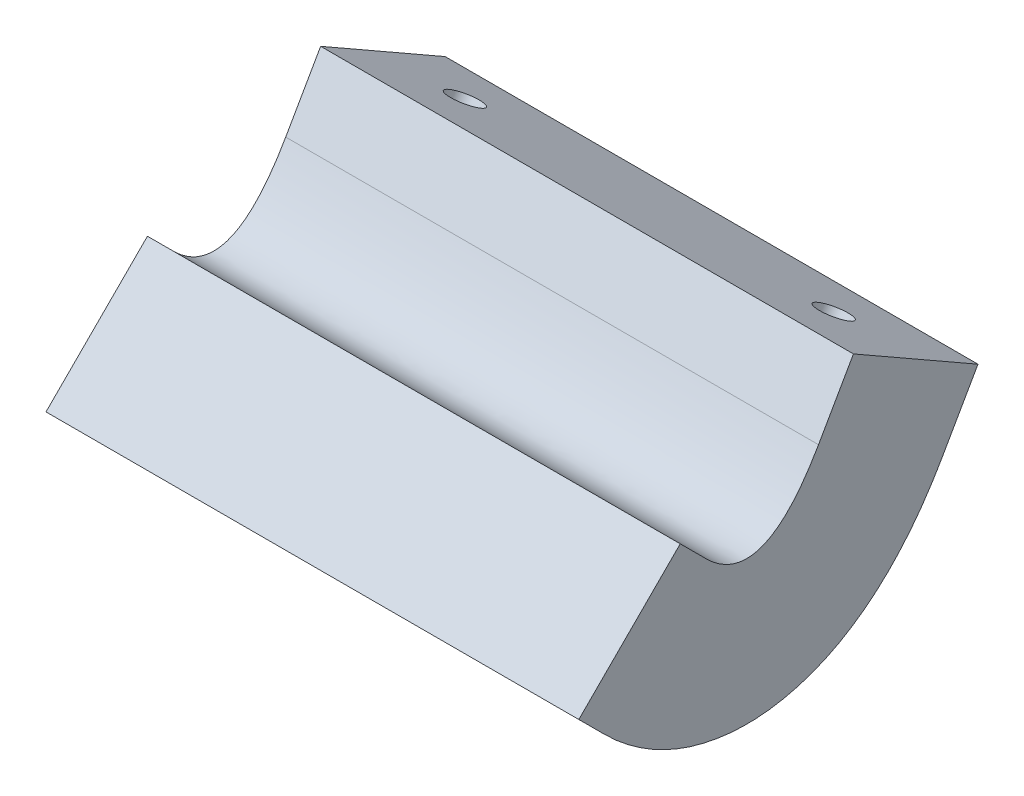
ISO-10303-21;
HEADER;
FILE_DESCRIPTION(('STEP AP214'),'2;1');
FILE_NAME('part.step','',(''),(''),'','','');
FILE_SCHEMA(('AUTOMOTIVE_DESIGN { 1 0 10303 214 1 1 1 1 }'));
ENDSEC;
DATA;
#1=APPLICATION_CONTEXT('core data for automotive mechanical design processes');
#2=APPLICATION_PROTOCOL_DEFINITION('international standard','automotive_design',2000,#1);
#3=PRODUCT_CONTEXT('',#1,'mechanical');
#4=PRODUCT('Part','Part','',(#3));
#5=PRODUCT_RELATED_PRODUCT_CATEGORY('part','',(#4));
#6=PRODUCT_DEFINITION_FORMATION('','',#4);
#7=PRODUCT_DEFINITION_CONTEXT('part definition',#1,'design');
#8=PRODUCT_DEFINITION('design','',#6,#7);
#9=PRODUCT_DEFINITION_SHAPE('','',#8);
#10=(LENGTH_UNIT() NAMED_UNIT(*) SI_UNIT(.MILLI.,.METRE.));
#11=(NAMED_UNIT(*) PLANE_ANGLE_UNIT() SI_UNIT($,.RADIAN.));
#12=(NAMED_UNIT(*) SI_UNIT($,.STERADIAN.) SOLID_ANGLE_UNIT());
#13=UNCERTAINTY_MEASURE_WITH_UNIT(LENGTH_MEASURE(1.E-05),#10,'distance_accuracy_value','');
#14=(GEOMETRIC_REPRESENTATION_CONTEXT(3) GLOBAL_UNCERTAINTY_ASSIGNED_CONTEXT((#13)) GLOBAL_UNIT_ASSIGNED_CONTEXT((#10,
#11,#12)) REPRESENTATION_CONTEXT('',''));
#15=CARTESIAN_POINT('',(0.,0.,0.));
#16=DIRECTION('',(0.,0.,1.));
#17=DIRECTION('',(1.,0.,0.));
#18=AXIS2_PLACEMENT_3D('',#15,#16,#17);
#19=CARTESIAN_POINT('',(26.,3.0624999999999,-3.49999999999994));
#20=CARTESIAN_POINT('',(26.,-1.75000000000185,-0.7499999999989));
#21=CARTESIAN_POINT('',(26.,1.00000000000214,2.00000000000214));
#22=B_SPLINE_CURVE_WITH_KNOTS('',2,(#19,#20,#21),.UNSPECIFIED.,.F.,.F.,(3,3),(0.075491359173156,
0.945774266619911),.UNSPECIFIED.);
#23=DIRECTION('',(-1.,0.,0.));
#24=VECTOR('',#23,1.);
#25=SURFACE_OF_LINEAR_EXTRUSION('',#22,#24);
#26=CARTESIAN_POINT('',(0.,3.0624999999999,-3.49999999999994));
#27=CARTESIAN_POINT('',(0.,-1.75000000000185,-0.7499999999989));
#28=CARTESIAN_POINT('',(0.,1.00000000000214,2.00000000000214));
#29=B_SPLINE_CURVE_WITH_KNOTS('',2,(#26,#27,#28),.UNSPECIFIED.,.F.,.F.,(3,3),(0.075491359173156,
0.945774266619911),.UNSPECIFIED.);
#30=CARTESIAN_POINT('',(0.,3.0625,-3.5));
#31=VERTEX_POINT('',#30);
#32=CARTESIAN_POINT('',(0.,1.,2.));
#33=VERTEX_POINT('',#32);
#34=EDGE_CURVE('E130',#31,#33,#29,.T.);
#35=ORIENTED_EDGE('',*,*,#34,.T.);
#36=DIRECTION('',(-1.,0.,0.));
#37=VECTOR('',#36,1.);
#38=CARTESIAN_POINT('',(26.,1.,2.));
#39=LINE('',#38,#37);
#40=CARTESIAN_POINT('',(26.,1.,2.));
#41=VERTEX_POINT('',#40);
#42=EDGE_CURVE('E11',#41,#33,#39,.T.);
#43=ORIENTED_EDGE('',*,*,#42,.F.);
#44=CARTESIAN_POINT('',(26.,3.0625,-3.5));
#45=VERTEX_POINT('',#44);
#46=EDGE_CURVE('E155',#45,#41,#22,.T.);
#47=ORIENTED_EDGE('',*,*,#46,.F.);
#48=DIRECTION('',(-1.,0.,0.));
#49=VECTOR('',#48,1.);
#50=CARTESIAN_POINT('',(26.,3.0625,-3.5));
#51=LINE('',#50,#49);
#52=EDGE_CURVE('E126',#45,#31,#51,.T.);
#53=ORIENTED_EDGE('',*,*,#52,.T.);
#54=EDGE_LOOP('',(#35,#43,#47,#53));
#55=FACE_BOUND('',#54,.T.);
#56=ADVANCED_FACE('F33',(#55),#25,.F.);
#57=CARTESIAN_POINT('',(26.,1.,2.));
#58=DIRECTION('',(0.,-0.707106781186169,0.707106781186926));
#59=DIRECTION('',(0.,-0.707106781186926,-0.707106781186169));
#60=AXIS2_PLACEMENT_3D('',#57,#58,#59);
#61=PLANE('',#60);
#62=DIRECTION('',(0.,0.707106781186926,0.707106781186169));
#63=VECTOR('',#62,1.);
#64=CARTESIAN_POINT('',(0.,1.,2.));
#65=LINE('',#64,#63);
#66=CARTESIAN_POINT('',(0.,2.24711483036491,3.24711483036358));
#67=VERTEX_POINT('',#66);
#68=EDGE_CURVE('E135',#33,#67,#65,.T.);
#69=ORIENTED_EDGE('',*,*,#68,.T.);
#70=DIRECTION('',(-1.,0.,0.));
#71=VECTOR('',#70,1.);
#72=CARTESIAN_POINT('',(26.,2.24711483036491,3.24711483036358));
#73=LINE('',#72,#71);
#74=CARTESIAN_POINT('',(26.,2.24711483036491,3.24711483036358));
#75=VERTEX_POINT('',#74);
#76=EDGE_CURVE('E42',#75,#67,#73,.T.);
#77=ORIENTED_EDGE('',*,*,#76,.F.);
#78=DIRECTION('',(0.,0.707106781186926,0.707106781186169));
#79=VECTOR('',#78,1.);
#80=CARTESIAN_POINT('',(26.,1.,2.));
#81=LINE('',#80,#79);
#82=EDGE_CURVE('E93',#41,#75,#81,.T.);
#83=ORIENTED_EDGE('',*,*,#82,.F.);
#84=ORIENTED_EDGE('',*,*,#42,.T.);
#85=EDGE_LOOP('',(#69,#77,#83,#84));
#86=FACE_BOUND('',#85,.T.);
#87=ADVANCED_FACE('F199',(#86),#61,.F.);
#88=CARTESIAN_POINT('',(26.,2.24711483036491,3.24711483036358));
#89=DIRECTION('',(0.,-0.707106781186926,-0.707106781186169));
#90=DIRECTION('',(0.,0.707106781186169,-0.707106781186926));
#91=AXIS2_PLACEMENT_3D('',#88,#89,#90);
#92=PLANE('',#91);
#93=DIRECTION('',(0.,-0.707106781186169,0.707106781186926));
#94=VECTOR('',#93,1.);
#95=CARTESIAN_POINT('',(0.,2.24711483036491,3.24711483036358));
#96=LINE('',#95,#94);
#97=CARTESIAN_POINT('',(0.,-2.70263263793827,8.19686229867206));
#98=VERTEX_POINT('',#97);
#99=EDGE_CURVE('E141',#67,#98,#96,.T.);
#100=ORIENTED_EDGE('',*,*,#99,.T.);
#101=DIRECTION('',(-1.,0.,0.));
#102=VECTOR('',#101,1.);
#103=CARTESIAN_POINT('',(26.,-2.70263263793827,8.19686229867206));
#104=LINE('',#103,#102);
#105=CARTESIAN_POINT('',(26.,-2.70263263793827,8.19686229867206));
#106=VERTEX_POINT('',#105);
#107=EDGE_CURVE('E162',#106,#98,#104,.T.);
#108=ORIENTED_EDGE('',*,*,#107,.F.);
#109=DIRECTION('',(0.,-0.707106781186169,0.707106781186926));
#110=VECTOR('',#109,1.);
#111=CARTESIAN_POINT('',(26.,2.24711483036491,3.24711483036358));
#112=LINE('',#111,#110);
#113=EDGE_CURVE('E170',#75,#106,#112,.T.);
#114=ORIENTED_EDGE('',*,*,#113,.F.);
#115=ORIENTED_EDGE('',*,*,#76,.T.);
#116=EDGE_LOOP('',(#100,#108,#114,#115));
#117=FACE_BOUND('',#116,.T.);
#118=ADVANCED_FACE('F168',(#117),#92,.F.);
#119=CARTESIAN_POINT('',(26.,-3.94974746830104,6.94974746831063));
#120=DIRECTION('',(0.,0.707106781186169,-0.707106781186926));
#121=DIRECTION('',(0.,0.707106781186926,0.707106781186169));
#122=AXIS2_PLACEMENT_3D('',#119,#120,#121);
#123=PLANE('',#122);
#124=DIRECTION('',(0.,-0.707106781186926,-0.707106781186169));
#125=VECTOR('',#124,1.);
#126=CARTESIAN_POINT('',(0.,-3.94974746830104,6.94974746831063));
#127=LINE('',#126,#125);
#128=CARTESIAN_POINT('',(0.,-3.94974746830104,6.94974746831063));
#129=VERTEX_POINT('',#128);
#130=EDGE_CURVE('E143',#98,#129,#127,.T.);
#131=ORIENTED_EDGE('',*,*,#130,.T.);
#132=DIRECTION('',(-1.,0.,0.));
#133=VECTOR('',#132,1.);
#134=CARTESIAN_POINT('',(26.,-3.94974746830104,6.94974746831063));
#135=LINE('',#134,#133);
#136=CARTESIAN_POINT('',(26.,-3.94974746830104,6.94974746831063));
#137=VERTEX_POINT('',#136);
#138=EDGE_CURVE('E159',#137,#129,#135,.T.);
#139=ORIENTED_EDGE('',*,*,#138,.F.);
#140=DIRECTION('',(0.,-0.707106781186926,-0.707106781186169));
#141=VECTOR('',#140,1.);
#142=CARTESIAN_POINT('',(26.,-3.94974746830104,6.94974746831063));
#143=LINE('',#142,#141);
#144=EDGE_CURVE('E182',#106,#137,#143,.T.);
#145=ORIENTED_EDGE('',*,*,#144,.F.);
#146=ORIENTED_EDGE('',*,*,#107,.T.);
#147=EDGE_LOOP('',(#131,#139,#145,#146));
#148=FACE_BOUND('',#147,.T.);
#149=ADVANCED_FACE('F178',(#148),#123,.F.);
#150=CARTESIAN_POINT('',(26.,-3.94974746830104,6.94974746831063));
#151=CARTESIAN_POINT('',(26.,-4.21412667106033,6.68536826555162));
#152=CARTESIAN_POINT('',(26.,-4.70831210448731,6.14755427106232));
#153=CARTESIAN_POINT('',(26.,-5.67452353358459,4.85907450000751));
#154=CARTESIAN_POINT('',(26.,-6.71279737563726,2.82698450082312));
#155=CARTESIAN_POINT('',(26.,-7.18416330973587,-0.295880791387765));
#156=CARTESIAN_POINT('',(26.,-6.52419720607772,-3.33032093509967));
#157=CARTESIAN_POINT('',(26.,-5.20112332386269,-5.63002001490046));
#158=CARTESIAN_POINT('',(26.,-3.16808651854692,-7.83974403195609));
#159=CARTESIAN_POINT('',(26.,-1.57401722300351,-8.91281933515368));
#160=CARTESIAN_POINT('',(26.,-0.410472568497979,-9.57770199487113));
#161=B_SPLINE_CURVE_WITH_KNOTS('',3,(#150,#151,#152,#153,#154,#155,#156,#157,#158,#159,#160),
.UNSPECIFIED.,.F.,.F.,(4,1,1,1,1,1,1,1,4),(0.075491359173156,0.129884040888578,0.184276722604,
0.293062086034845,0.401847449465689,0.510632812896533,0.619418176327378,0.728203539758222,
0.945774266619911),.UNSPECIFIED.);
#162=DIRECTION('',(-1.,0.,0.));
#163=VECTOR('',#162,1.);
#164=SURFACE_OF_LINEAR_EXTRUSION('',#161,#163);
#165=CARTESIAN_POINT('',(0.,-3.94974746830104,6.94974746831063));
#166=CARTESIAN_POINT('',(0.,-4.21412667106033,6.68536826555162));
#167=CARTESIAN_POINT('',(0.,-4.70831210448731,6.14755427106232));
#168=CARTESIAN_POINT('',(0.,-5.67452353358459,4.85907450000751));
#169=CARTESIAN_POINT('',(0.,-6.71279737563726,2.82698450082312));
#170=CARTESIAN_POINT('',(0.,-7.18416330973587,-0.295880791387765));
#171=CARTESIAN_POINT('',(0.,-6.52419720607772,-3.33032093509967));
#172=CARTESIAN_POINT('',(0.,-5.20112332386269,-5.63002001490046));
#173=CARTESIAN_POINT('',(0.,-3.16808651854692,-7.83974403195609));
#174=CARTESIAN_POINT('',(0.,-1.57401722300351,-8.91281933515368));
#175=CARTESIAN_POINT('',(0.,-0.410472568497979,-9.57770199487113));
#176=B_SPLINE_CURVE_WITH_KNOTS('',3,(#165,#166,#167,#168,#169,#170,#171,#172,#173,#174,#175),
.UNSPECIFIED.,.F.,.F.,(4,1,1,1,1,1,1,1,4),(0.075491359173156,0.129884040888578,0.184276722604,
0.293062086034845,0.401847449465689,0.510632812896533,0.619418176327378,0.728203539758222,
0.945774266619911),.UNSPECIFIED.);
#177=CARTESIAN_POINT('',(0.,-0.410472568497979,-9.57770199487113));
#178=VERTEX_POINT('',#177);
#179=EDGE_CURVE('E145',#129,#178,#176,.T.);
#180=ORIENTED_EDGE('',*,*,#179,.T.);
#181=DIRECTION('',(-1.,0.,0.));
#182=VECTOR('',#181,1.);
#183=CARTESIAN_POINT('',(26.,-0.410472568497979,-9.57770199487113));
#184=LINE('',#183,#182);
#185=CARTESIAN_POINT('',(26.,-0.410472568497979,-9.57770199487113));
#186=VERTEX_POINT('',#185);
#187=EDGE_CURVE('E121',#186,#178,#184,.T.);
#188=ORIENTED_EDGE('',*,*,#187,.F.);
#189=EDGE_CURVE('E112',#137,#186,#161,.T.);
#190=ORIENTED_EDGE('',*,*,#189,.F.);
#191=ORIENTED_EDGE('',*,*,#138,.T.);
#192=EDGE_LOOP('',(#180,#188,#190,#191));
#193=FACE_BOUND('',#192,.T.);
#194=ADVANCED_FACE('F181',(#193),#164,.F.);
#195=CARTESIAN_POINT('',(26.,-0.410472568497979,-9.57770199487113));
#196=DIRECTION('',(0.,0.49613893835684,0.868243142124456));
#197=DIRECTION('',(0.,-0.868243142124456,0.49613893835684));
#198=AXIS2_PLACEMENT_3D('',#195,#196,#197);
#199=PLANE('',#198);
#200=DIRECTION('',(0.,0.868243142124456,-0.49613893835684));
#201=VECTOR('',#200,1.);
#202=CARTESIAN_POINT('',(0.,-0.410472568497979,-9.57770199487113));
#203=LINE('',#202,#201);
#204=CARTESIAN_POINT('',(0.,2.5733927824759,-11.2827679097134));
#205=VERTEX_POINT('',#204);
#206=EDGE_CURVE('E120',#178,#205,#203,.T.);
#207=ORIENTED_EDGE('',*,*,#206,.T.);
#208=DIRECTION('',(-1.,0.,0.));
#209=VECTOR('',#208,1.);
#210=CARTESIAN_POINT('',(26.,2.5733927824759,-11.2827679097134));
#211=LINE('',#210,#209);
#212=CARTESIAN_POINT('',(26.,2.5733927824759,-11.2827679097134));
#213=VERTEX_POINT('',#212);
#214=EDGE_CURVE('E117',#213,#205,#211,.T.);
#215=ORIENTED_EDGE('',*,*,#214,.F.);
#216=DIRECTION('',(0.,0.868243142124456,-0.49613893835684));
#217=VECTOR('',#216,1.);
#218=CARTESIAN_POINT('',(26.,-0.410472568497979,-9.57770199487113));
#219=LINE('',#218,#217);
#220=EDGE_CURVE('E106',#186,#213,#219,.T.);
#221=ORIENTED_EDGE('',*,*,#220,.F.);
#222=ORIENTED_EDGE('',*,*,#187,.T.);
#223=EDGE_LOOP('',(#207,#215,#221,#222));
#224=FACE_BOUND('',#223,.T.);
#225=ADVANCED_FACE('F118',(#224),#199,.F.);
#226=CARTESIAN_POINT('',(26.,2.5733927824759,-11.2827679097134));
#227=DIRECTION('',(0.,-0.868243142124456,0.49613893835684));
#228=DIRECTION('',(0.,-0.49613893835684,-0.868243142124456));
#229=AXIS2_PLACEMENT_3D('',#226,#227,#228);
#230=PLANE('',#229);
#231=CARTESIAN_POINT('',(3.99999999999999,4.30987906672484,-8.24391691227778));
#232=DIRECTION('',(0.,0.868243142124456,-0.49613893835684));
#233=DIRECTION('',(0.,0.49613893835684,0.868243142124456));
#234=AXIS2_PLACEMENT_3D('',#231,#232,#233);
#235=CIRCLE('',#234,0.799999999987501);
#236=CARTESIAN_POINT('',(3.99999999999999,4.70679021740411,-7.54932239858907));
#237=VERTEX_POINT('',#236);
#238=EDGE_CURVE('E238',#237,#237,#235,.T.);
#239=ORIENTED_EDGE('',*,*,#238,.F.);
#240=EDGE_LOOP('',(#239));
#241=FACE_BOUND('',#240,.T.);
#242=CARTESIAN_POINT('',(22.,4.30987906672484,-8.24391691227779));
#243=DIRECTION('',(0.,0.868243142124456,-0.49613893835684));
#244=DIRECTION('',(0.,0.49613893835684,0.868243142124456));
#245=AXIS2_PLACEMENT_3D('',#242,#243,#244);
#246=CIRCLE('',#245,0.799999999987508);
#247=CARTESIAN_POINT('',(22.,4.70679021740411,-7.54932239858907));
#248=VERTEX_POINT('',#247);
#249=EDGE_CURVE('E246',#248,#248,#246,.T.);
#250=ORIENTED_EDGE('',*,*,#249,.F.);
#251=EDGE_LOOP('',(#250));
#252=FACE_BOUND('',#251,.T.);
#253=DIRECTION('',(0.,0.49613893835684,0.868243142124456));
#254=VECTOR('',#253,1.);
#255=CARTESIAN_POINT('',(0.,2.5733927824759,-11.2827679097134));
#256=LINE('',#255,#254);
#257=CARTESIAN_POINT('',(0.,6.04636535097378,-5.20506591484219));
#258=VERTEX_POINT('',#257);
#259=EDGE_CURVE('E79',#205,#258,#256,.T.);
#260=ORIENTED_EDGE('',*,*,#259,.T.);
#261=DIRECTION('',(-1.,0.,0.));
#262=VECTOR('',#261,1.);
#263=CARTESIAN_POINT('',(26.,6.04636535097378,-5.20506591484219));
#264=LINE('',#263,#262);
#265=CARTESIAN_POINT('',(26.,6.04636535097378,-5.20506591484219));
#266=VERTEX_POINT('',#265);
#267=EDGE_CURVE('E122',#266,#258,#264,.T.);
#268=ORIENTED_EDGE('',*,*,#267,.F.);
#269=DIRECTION('',(0.,0.49613893835684,0.868243142124456));
#270=VECTOR('',#269,1.);
#271=CARTESIAN_POINT('',(26.,2.5733927824759,-11.2827679097134));
#272=LINE('',#271,#270);
#273=EDGE_CURVE('E110',#213,#266,#272,.T.);
#274=ORIENTED_EDGE('',*,*,#273,.F.);
#275=ORIENTED_EDGE('',*,*,#214,.T.);
#276=EDGE_LOOP('',(#260,#268,#274,#275));
#277=FACE_BOUND('',#276,.T.);
#278=ADVANCED_FACE('F124',(#241,#252,#277),#230,.F.);
#279=CARTESIAN_POINT('',(26.,3.0625,-3.5));
#280=DIRECTION('',(0.,-0.49613893835684,-0.868243142124456));
#281=DIRECTION('',(0.,0.868243142124456,-0.49613893835684));
#282=AXIS2_PLACEMENT_3D('',#279,#280,#281);
#283=PLANE('',#282);
#284=DIRECTION('',(0.,-0.868243142124456,0.49613893835684));
#285=VECTOR('',#284,1.);
#286=CARTESIAN_POINT('',(0.,3.0625,-3.5));
#287=LINE('',#286,#285);
#288=EDGE_CURVE('E85',#258,#31,#287,.T.);
#289=ORIENTED_EDGE('',*,*,#288,.T.);
#290=ORIENTED_EDGE('',*,*,#52,.F.);
#291=DIRECTION('',(0.,-0.868243142124456,0.49613893835684));
#292=VECTOR('',#291,1.);
#293=CARTESIAN_POINT('',(26.,3.0625,-3.5));
#294=LINE('',#293,#292);
#295=EDGE_CURVE('E50',#266,#45,#294,.T.);
#296=ORIENTED_EDGE('',*,*,#295,.F.);
#297=ORIENTED_EDGE('',*,*,#267,.T.);
#298=EDGE_LOOP('',(#289,#290,#296,#297));
#299=FACE_BOUND('',#298,.T.);
#300=ADVANCED_FACE('F207',(#299),#283,.F.);
#301=CARTESIAN_POINT('',(26.,0.140624999999588,-0.7499999999989));
#302=DIRECTION('',(-1.,0.,0.));
#303=DIRECTION('',(0.,0.,1.));
#304=AXIS2_PLACEMENT_3D('',#301,#302,#303);
#305=PLANE('',#304);
#306=ORIENTED_EDGE('',*,*,#46,.T.);
#307=ORIENTED_EDGE('',*,*,#82,.T.);
#308=ORIENTED_EDGE('',*,*,#113,.T.);
#309=ORIENTED_EDGE('',*,*,#144,.T.);
#310=ORIENTED_EDGE('',*,*,#189,.T.);
#311=ORIENTED_EDGE('',*,*,#220,.T.);
#312=ORIENTED_EDGE('',*,*,#273,.T.);
#313=ORIENTED_EDGE('',*,*,#295,.T.);
#314=EDGE_LOOP('',(#306,#307,#308,#309,#310,#311,#312,#313));
#315=FACE_BOUND('',#314,.T.);
#316=ADVANCED_FACE('F108',(#315),#305,.F.);
#317=CARTESIAN_POINT('',(0.,0.140624999999588,-0.7499999999989));
#318=DIRECTION('',(-1.,0.,0.));
#319=DIRECTION('',(0.,0.,1.));
#320=AXIS2_PLACEMENT_3D('',#317,#318,#319);
#321=PLANE('',#320);
#322=ORIENTED_EDGE('',*,*,#34,.F.);
#323=ORIENTED_EDGE('',*,*,#288,.F.);
#324=ORIENTED_EDGE('',*,*,#259,.F.);
#325=ORIENTED_EDGE('',*,*,#206,.F.);
#326=ORIENTED_EDGE('',*,*,#179,.F.);
#327=ORIENTED_EDGE('',*,*,#130,.F.);
#328=ORIENTED_EDGE('',*,*,#99,.F.);
#329=ORIENTED_EDGE('',*,*,#68,.F.);
#330=EDGE_LOOP('',(#322,#323,#324,#325,#326,#327,#328,#329));
#331=FACE_BOUND('',#330,.T.);
#332=ADVANCED_FACE('F174',(#331),#321,.T.);
#333=CARTESIAN_POINT('',(22.,-1.76782292814635,-4.77094434377991));
#334=DIRECTION('',(0.,0.868243142124456,-0.49613893835684));
#335=DIRECTION('',(0.,0.49613893835684,0.868243142124456));
#336=AXIS2_PLACEMENT_3D('',#333,#334,#335);
#337=CYLINDRICAL_SURFACE('',#336,0.799999999987508);
#338=CARTESIAN_POINT('',(22.,-1.76782292814635,-4.77094434377991));
#339=DIRECTION('',(0.,0.868243142124456,-0.49613893835684));
#340=DIRECTION('',(0.,0.49613893835684,0.868243142124456));
#341=AXIS2_PLACEMENT_3D('',#338,#339,#340);
#342=CIRCLE('',#341,0.799999999987508);
#343=CARTESIAN_POINT('',(22.,-1.37091177746708,-4.07634983009119));
#344=VERTEX_POINT('',#343);
#345=EDGE_CURVE('E241',#344,#344,#342,.T.);
#346=ORIENTED_EDGE('',*,*,#345,.F.);
#347=EDGE_LOOP('',(#346));
#348=FACE_BOUND('',#347,.T.);
#349=ORIENTED_EDGE('',*,*,#249,.T.);
#350=EDGE_LOOP('',(#349));
#351=FACE_BOUND('',#350,.T.);
#352=ADVANCED_FACE('F218',(#348,#351),#337,.F.);
#353=CARTESIAN_POINT('',(22.,-1.76782292814635,-4.77094434377991));
#354=DIRECTION('',(0.,0.868243142124456,-0.49613893835684));
#355=DIRECTION('',(0.,0.49613893835684,0.868243142124456));
#356=AXIS2_PLACEMENT_3D('',#353,#354,#355);
#357=PLANE('',#356);
#358=ORIENTED_EDGE('',*,*,#345,.T.);
#359=EDGE_LOOP('',(#358));
#360=FACE_BOUND('',#359,.T.);
#361=ADVANCED_FACE('F222',(#360),#357,.T.);
#362=CARTESIAN_POINT('',(3.99999999999999,-1.76782292814635,-4.77094434377991));
#363=DIRECTION('',(0.,0.868243142124456,-0.49613893835684));
#364=DIRECTION('',(0.,0.49613893835684,0.868243142124456));
#365=AXIS2_PLACEMENT_3D('',#362,#363,#364);
#366=CYLINDRICAL_SURFACE('',#365,0.799999999987501);
#367=CARTESIAN_POINT('',(3.99999999999999,-1.76782292814635,-4.77094434377991));
#368=DIRECTION('',(0.,0.868243142124456,-0.49613893835684));
#369=DIRECTION('',(0.,0.49613893835684,0.868243142124456));
#370=AXIS2_PLACEMENT_3D('',#367,#368,#369);
#371=CIRCLE('',#370,0.799999999987501);
#372=CARTESIAN_POINT('',(3.99999999999999,-1.37091177746708,-4.07634983009119));
#373=VERTEX_POINT('',#372);
#374=EDGE_CURVE('E136',#373,#373,#371,.T.);
#375=ORIENTED_EDGE('',*,*,#374,.F.);
#376=EDGE_LOOP('',(#375));
#377=FACE_BOUND('',#376,.T.);
#378=ORIENTED_EDGE('',*,*,#238,.T.);
#379=EDGE_LOOP('',(#378));
#380=FACE_BOUND('',#379,.T.);
#381=ADVANCED_FACE('F226',(#377,#380),#366,.F.);
#382=CARTESIAN_POINT('',(3.99999999999999,-1.76782292814635,-4.77094434377991));
#383=DIRECTION('',(0.,0.868243142124456,-0.49613893835684));
#384=DIRECTION('',(0.,0.49613893835684,0.868243142124456));
#385=AXIS2_PLACEMENT_3D('',#382,#383,#384);
#386=PLANE('',#385);
#387=ORIENTED_EDGE('',*,*,#374,.T.);
#388=EDGE_LOOP('',(#387));
#389=FACE_BOUND('',#388,.T.);
#390=ADVANCED_FACE('F230',(#389),#386,.T.);
#391=CLOSED_SHELL('',(#56,#87,#118,#149,#194,#225,#278,#300,#316,#332,#352,#361,#381,#390));
#392=MANIFOLD_SOLID_BREP('B2',#391);
#393=ADVANCED_BREP_SHAPE_REPRESENTATION('',(#18,#392),#14);
#394=SHAPE_DEFINITION_REPRESENTATION(#9,#393);
ENDSEC;
END-ISO-10303-21;
